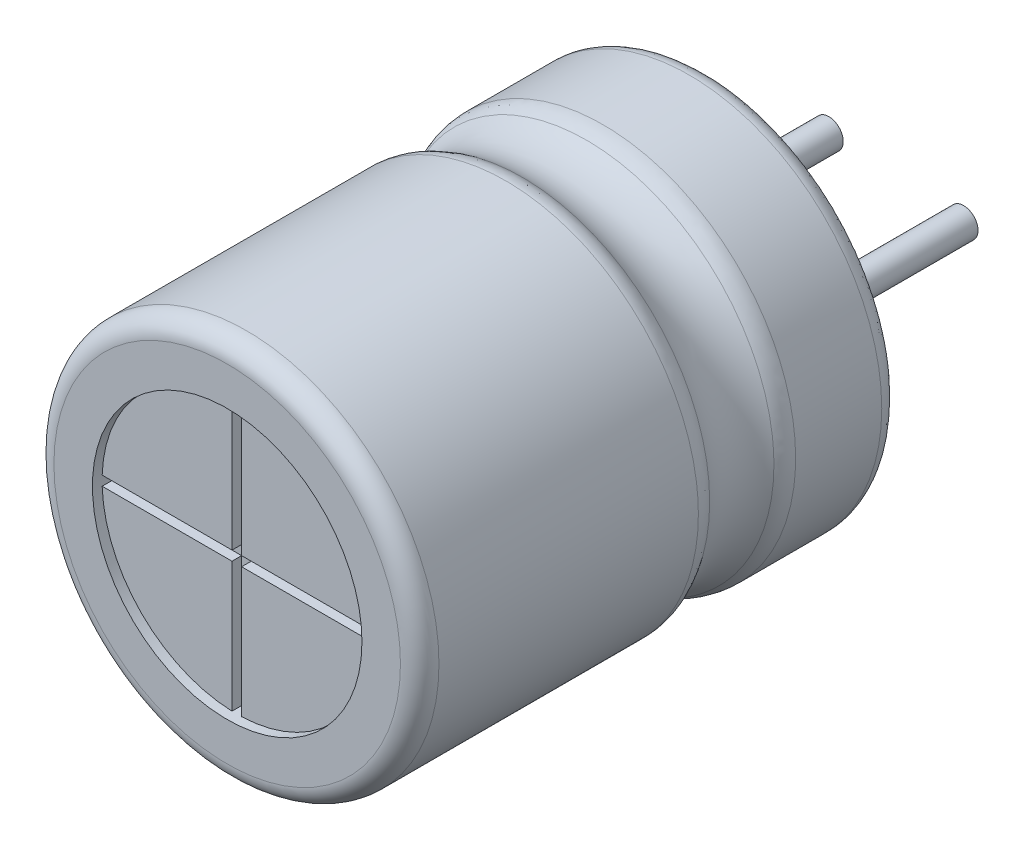
ISO-10303-21;
HEADER;
FILE_DESCRIPTION(('STEP AP214'),'2;1');
FILE_NAME('part.step','',(''),(''),'','','');
FILE_SCHEMA(('AUTOMOTIVE_DESIGN { 1 0 10303 214 1 1 1 1 }'));
ENDSEC;
DATA;
#1=APPLICATION_CONTEXT('core data for automotive mechanical design processes');
#2=APPLICATION_PROTOCOL_DEFINITION('international standard','automotive_design',2000,#1);
#3=PRODUCT_CONTEXT('',#1,'mechanical');
#4=PRODUCT('Part','Part','',(#3));
#5=PRODUCT_RELATED_PRODUCT_CATEGORY('part','',(#4));
#6=PRODUCT_DEFINITION_FORMATION('','',#4);
#7=PRODUCT_DEFINITION_CONTEXT('part definition',#1,'design');
#8=PRODUCT_DEFINITION('design','',#6,#7);
#9=PRODUCT_DEFINITION_SHAPE('','',#8);
#10=(LENGTH_UNIT() NAMED_UNIT(*) SI_UNIT(.MILLI.,.METRE.));
#11=(NAMED_UNIT(*) PLANE_ANGLE_UNIT() SI_UNIT($,.RADIAN.));
#12=(NAMED_UNIT(*) SI_UNIT($,.STERADIAN.) SOLID_ANGLE_UNIT());
#13=UNCERTAINTY_MEASURE_WITH_UNIT(LENGTH_MEASURE(1.E-05),#10,'distance_accuracy_value','');
#14=(GEOMETRIC_REPRESENTATION_CONTEXT(3) GLOBAL_UNCERTAINTY_ASSIGNED_CONTEXT((#13)) GLOBAL_UNIT_ASSIGNED_CONTEXT((#10,
#11,#12)) REPRESENTATION_CONTEXT('',''));
#15=CARTESIAN_POINT('',(0.,0.,0.));
#16=DIRECTION('',(0.,0.,1.));
#17=DIRECTION('',(1.,0.,0.));
#18=AXIS2_PLACEMENT_3D('',#15,#16,#17);
#19=CARTESIAN_POINT('',(1.5,0.,-1.9));
#20=DIRECTION('',(0.,0.,1.));
#21=DIRECTION('',(1.,0.,0.));
#22=AXIS2_PLACEMENT_3D('',#19,#20,#21);
#23=PLANE('',#22);
#24=CARTESIAN_POINT('',(1.5,0.,-1.9));
#25=DIRECTION('',(0.,0.,1.));
#26=DIRECTION('',(-1.,0.,0.));
#27=AXIS2_PLACEMENT_3D('',#24,#25,#26);
#28=CIRCLE('',#27,0.15);
#29=CARTESIAN_POINT('',(1.35,0.,-1.9));
#30=VERTEX_POINT('',#29);
#31=EDGE_CURVE('E31',#30,#30,#28,.T.);
#32=ORIENTED_EDGE('',*,*,#31,.F.);
#33=EDGE_LOOP('',(#32));
#34=FACE_BOUND('',#33,.T.);
#35=ADVANCED_FACE('F18',(#34),#23,.F.);
#36=CARTESIAN_POINT('',(1.5,0.,0.3));
#37=DIRECTION('',(0.,0.,1.));
#38=DIRECTION('',(-1.,0.,0.));
#39=AXIS2_PLACEMENT_3D('',#36,#37,#38);
#40=CYLINDRICAL_SURFACE('',#39,0.15);
#41=CARTESIAN_POINT('',(1.5,0.,0.2));
#42=DIRECTION('',(0.,0.,1.));
#43=DIRECTION('',(-1.,0.,0.));
#44=AXIS2_PLACEMENT_3D('',#41,#42,#43);
#45=CIRCLE('',#44,0.15);
#46=CARTESIAN_POINT('',(1.35,0.,0.2));
#47=VERTEX_POINT('',#46);
#48=EDGE_CURVE('E798',#47,#47,#45,.T.);
#49=ORIENTED_EDGE('',*,*,#48,.F.);
#50=DIRECTION('',(0.,0.,-1.));
#51=VECTOR('',#50,1.);
#52=CARTESIAN_POINT('',(1.35,0.,0.3));
#53=LINE('',#52,#51);
#54=EDGE_CURVE('E11',#47,#30,#53,.T.);
#55=ORIENTED_EDGE('',*,*,#54,.T.);
#56=ORIENTED_EDGE('',*,*,#31,.T.);
#57=ORIENTED_EDGE('',*,*,#54,.F.);
#58=EDGE_LOOP('',(#49,#55,#56,#57));
#59=FACE_BOUND('',#58,.T.);
#60=ADVANCED_FACE('F453',(#59),#40,.T.);
#61=CARTESIAN_POINT('',(0.75,0.,0.2));
#62=DIRECTION('',(0.,0.,1.));
#63=DIRECTION('',(1.,0.,0.));
#64=AXIS2_PLACEMENT_3D('',#61,#62,#63);
#65=PLANE('',#64);
#66=CARTESIAN_POINT('',(0.75,0.,0.2));
#67=DIRECTION('',(0.,0.,1.));
#68=DIRECTION('',(1.,0.,0.));
#69=AXIS2_PLACEMENT_3D('',#66,#67,#68);
#70=CIRCLE('',#69,1.4);
#71=CARTESIAN_POINT('',(2.15,0.,0.2));
#72=VERTEX_POINT('',#71);
#73=EDGE_CURVE('E795',#72,#72,#70,.T.);
#74=ORIENTED_EDGE('',*,*,#73,.F.);
#75=EDGE_LOOP('',(#74));
#76=FACE_BOUND('',#75,.T.);
#77=ORIENTED_EDGE('',*,*,#48,.T.);
#78=EDGE_LOOP('',(#77));
#79=FACE_BOUND('',#78,.T.);
#80=CARTESIAN_POINT('',(0.,0.,0.2));
#81=DIRECTION('',(0.,0.,1.));
#82=DIRECTION('',(-1.,0.,0.));
#83=AXIS2_PLACEMENT_3D('',#80,#81,#82);
#84=CIRCLE('',#83,0.15);
#85=CARTESIAN_POINT('',(-0.15,0.,0.2));
#86=VERTEX_POINT('',#85);
#87=EDGE_CURVE('E801',#86,#86,#84,.T.);
#88=ORIENTED_EDGE('',*,*,#87,.T.);
#89=EDGE_LOOP('',(#88));
#90=FACE_BOUND('',#89,.T.);
#91=ADVANCED_FACE('F401',(#76,#79,#90),#65,.F.);
#92=CARTESIAN_POINT('',(0.75,0.,0.3));
#93=DIRECTION('',(0.,0.,-1.));
#94=DIRECTION('',(1.,0.,0.));
#95=AXIS2_PLACEMENT_3D('',#92,#93,#94);
#96=CYLINDRICAL_SURFACE('',#95,1.4);
#97=DIRECTION('',(0.,0.,-1.));
#98=VECTOR('',#97,1.);
#99=CARTESIAN_POINT('',(2.15,0.,0.3));
#100=LINE('',#99,#98);
#101=CARTESIAN_POINT('',(2.15,0.,0.));
#102=VERTEX_POINT('',#101);
#103=EDGE_CURVE('E805',#72,#102,#100,.T.);
#104=ORIENTED_EDGE('',*,*,#103,.T.);
#105=CARTESIAN_POINT('',(0.75,0.,0.));
#106=DIRECTION('',(0.,0.,-1.));
#107=DIRECTION('',(1.,0.,0.));
#108=AXIS2_PLACEMENT_3D('',#105,#106,#107);
#109=CIRCLE('',#108,1.4);
#110=EDGE_CURVE('E816',#102,#102,#109,.T.);
#111=ORIENTED_EDGE('',*,*,#110,.T.);
#112=ORIENTED_EDGE('',*,*,#103,.F.);
#113=ORIENTED_EDGE('',*,*,#73,.T.);
#114=EDGE_LOOP('',(#104,#111,#112,#113));
#115=FACE_BOUND('',#114,.T.);
#116=ADVANCED_FACE('F437',(#115),#96,.F.);
#117=CARTESIAN_POINT('',(0.,0.,0.3));
#118=DIRECTION('',(0.,0.,1.));
#119=DIRECTION('',(-1.,0.,0.));
#120=AXIS2_PLACEMENT_3D('',#117,#118,#119);
#121=CYLINDRICAL_SURFACE('',#120,0.15);
#122=ORIENTED_EDGE('',*,*,#87,.F.);
#123=DIRECTION('',(0.,0.,-1.));
#124=VECTOR('',#123,1.);
#125=CARTESIAN_POINT('',(-0.15,0.,0.3));
#126=LINE('',#125,#124);
#127=CARTESIAN_POINT('',(-0.15,0.,-2.));
#128=VERTEX_POINT('',#127);
#129=EDGE_CURVE('E808',#86,#128,#126,.T.);
#130=ORIENTED_EDGE('',*,*,#129,.T.);
#131=CARTESIAN_POINT('',(0.,0.,-2.));
#132=DIRECTION('',(0.,0.,1.));
#133=DIRECTION('',(-1.,0.,0.));
#134=AXIS2_PLACEMENT_3D('',#131,#132,#133);
#135=CIRCLE('',#134,0.15);
#136=EDGE_CURVE('E809',#128,#128,#135,.T.);
#137=ORIENTED_EDGE('',*,*,#136,.T.);
#138=ORIENTED_EDGE('',*,*,#129,.F.);
#139=EDGE_LOOP('',(#122,#130,#137,#138));
#140=FACE_BOUND('',#139,.T.);
#141=ADVANCED_FACE('F317',(#140),#121,.T.);
#142=CARTESIAN_POINT('',(0.75,0.,0.));
#143=DIRECTION('',(0.,0.,-1.));
#144=DIRECTION('',(0.,-1.,0.));
#145=AXIS2_PLACEMENT_3D('',#142,#143,#144);
#146=PLANE('',#145);
#147=ORIENTED_EDGE('',*,*,#110,.F.);
#148=EDGE_LOOP('',(#147));
#149=FACE_BOUND('',#148,.T.);
#150=CARTESIAN_POINT('',(0.75,0.,0.));
#151=DIRECTION('',(0.,0.,-1.));
#152=DIRECTION('',(1.,0.,0.));
#153=AXIS2_PLACEMENT_3D('',#150,#151,#152);
#154=CIRCLE('',#153,1.8);
#155=CARTESIAN_POINT('',(2.55,0.,0.));
#156=VERTEX_POINT('',#155);
#157=EDGE_CURVE('E819',#156,#156,#154,.T.);
#158=ORIENTED_EDGE('',*,*,#157,.T.);
#159=EDGE_LOOP('',(#158));
#160=FACE_BOUND('',#159,.T.);
#161=ADVANCED_FACE('F313',(#149,#160),#146,.T.);
#162=CARTESIAN_POINT('',(0.,0.,-2.));
#163=DIRECTION('',(0.,0.,1.));
#164=DIRECTION('',(1.,0.,0.));
#165=AXIS2_PLACEMENT_3D('',#162,#163,#164);
#166=PLANE('',#165);
#167=ORIENTED_EDGE('',*,*,#136,.F.);
#168=EDGE_LOOP('',(#167));
#169=FACE_BOUND('',#168,.T.);
#170=ADVANCED_FACE('F250',(#169),#166,.F.);
#171=CARTESIAN_POINT('',(2.55,0.,0.));
#172=CARTESIAN_POINT('',(2.66715728752538,0.,0.));
#173=CARTESIAN_POINT('',(2.75,0.,0.0828427124746191));
#174=CARTESIAN_POINT('',(2.75,0.,0.2));
#175=(BOUNDED_CURVE() B_SPLINE_CURVE(3,(#171,#172,#173,#174),.UNSPECIFIED.,.F.,
.F.) B_SPLINE_CURVE_WITH_KNOTS((4,4),(0.,1.),
.UNSPECIFIED.) CURVE() GEOMETRIC_REPRESENTATION_ITEM() RATIONAL_B_SPLINE_CURVE((1.,
0.804737854124365,0.804737854124365,1.)) REPRESENTATION_ITEM(''));
#176=CARTESIAN_POINT('',(0.75,0.,0.));
#177=DIRECTION('',(0.,0.,1.));
#178=AXIS1_PLACEMENT('',#176,#177);
#179=SURFACE_OF_REVOLUTION('',#175,#178);
#180=CARTESIAN_POINT('',(2.55,0.,0.2));
#181=DIRECTION('',(0.,-1.,0.));
#182=DIRECTION('',(0.,0.,-1.));
#183=AXIS2_PLACEMENT_3D('',#180,#181,#182);
#184=CIRCLE('',#183,0.2);
#185=CARTESIAN_POINT('',(2.75,0.,0.2));
#186=VERTEX_POINT('',#185);
#187=EDGE_CURVE('E834',#156,#186,#184,.T.);
#188=ORIENTED_EDGE('',*,*,#187,.T.);
#189=CARTESIAN_POINT('',(0.75,0.,0.2));
#190=DIRECTION('',(0.,0.,-1.));
#191=DIRECTION('',(1.,0.,0.));
#192=AXIS2_PLACEMENT_3D('',#189,#190,#191);
#193=CIRCLE('',#192,2.);
#194=EDGE_CURVE('E838',#186,#186,#193,.T.);
#195=ORIENTED_EDGE('',*,*,#194,.T.);
#196=ORIENTED_EDGE('',*,*,#187,.F.);
#197=ORIENTED_EDGE('',*,*,#157,.F.);
#198=EDGE_LOOP('',(#188,#195,#196,#197));
#199=FACE_BOUND('',#198,.T.);
#200=ADVANCED_FACE('F246',(#199),#179,.T.);
#201=CARTESIAN_POINT('',(0.75,0.,0.2));
#202=DIRECTION('',(0.,0.,1.));
#203=DIRECTION('',(1.,0.,0.));
#204=AXIS2_PLACEMENT_3D('',#201,#202,#203);
#205=CYLINDRICAL_SURFACE('',#204,2.);
#206=CARTESIAN_POINT('',(2.75,0.,1.094848017031));
#207=CARTESIAN_POINT('',(2.75,0.952660709411,1.094848017031));
#208=CARTESIAN_POINT('',(2.257633513842,1.9272904927,1.094848017031));
#209=CARTESIAN_POINT('',(1.244412228651,2.624192256694,1.094848017031));
#210=CARTESIAN_POINT('',(-0.149908868318,2.731223086318,1.094848017031));
#211=CARTESIAN_POINT('',(-1.354436335487,1.988436120794,1.094848017031));
#212=CARTESIAN_POINT('',(-2.237830703038,0.90413309659,1.094848017031));
#213=CARTESIAN_POINT('',(-2.237830702984,-0.904133096575,1.094848017031));
#214=CARTESIAN_POINT('',(-1.354436335519,-1.988436120821,1.094848017031));
#215=CARTESIAN_POINT('',(-0.149908868309,-2.731223086294,1.094848017031));
#216=CARTESIAN_POINT('',(1.244412228653,-2.624192256705,1.094848017031));
#217=CARTESIAN_POINT('',(2.257633513839,-1.927290492697,1.094848017031));
#218=CARTESIAN_POINT('',(2.750000000001,-0.952660709411,1.094848017031));
#219=CARTESIAN_POINT('',(2.75,0.,1.094848017031));
#220=(BOUNDED_CURVE() B_SPLINE_CURVE(13,(#206,#207,#208,#209,#210,#211,#212,#213,#214,#215,#216,
#217,#218,#219),.UNSPECIFIED.,.T.,.F.) B_SPLINE_CURVE_WITH_KNOTS((14,14),(0.,12.566370614359),
.UNSPECIFIED.) CURVE() GEOMETRIC_REPRESENTATION_ITEM() RATIONAL_B_SPLINE_CURVE((1.,1.,
0.999999999999,1.000000000002,0.999999999996,1.000000000006,0.999999999992,1.000000000009,
0.999999999991,1.000000000006,0.999999999997,1.000000000001,1.,1.)) REPRESENTATION_ITEM(''));
#221=CARTESIAN_POINT('',(2.75,0.,1.094848017031));
#222=VERTEX_POINT('',#221);
#223=EDGE_CURVE('E1036',#222,#222,#220,.F.);
#224=ORIENTED_EDGE('',*,*,#223,.T.);
#225=DIRECTION('',(0.,0.,1.));
#226=VECTOR('',#225,1.);
#227=CARTESIAN_POINT('',(2.75,0.,0.2));
#228=LINE('',#227,#226);
#229=EDGE_CURVE('E1034',#186,#222,#228,.T.);
#230=ORIENTED_EDGE('',*,*,#229,.F.);
#231=ORIENTED_EDGE('',*,*,#194,.F.);
#232=ORIENTED_EDGE('',*,*,#229,.T.);
#233=EDGE_LOOP('',(#224,#230,#231,#232));
#234=FACE_BOUND('',#233,.T.);
#235=ADVANCED_FACE('F249',(#234),#205,.T.);
#236=CARTESIAN_POINT('',(2.75,0.,1.094848017031));
#237=CARTESIAN_POINT('',(2.750000000001,-0.952660709411,1.094848017031));
#238=CARTESIAN_POINT('',(2.257633513839,-1.927290492697,1.094848017031));
#239=CARTESIAN_POINT('',(1.244412228653,-2.624192256705,1.094848017031));
#240=CARTESIAN_POINT('',(-0.149908868309,-2.731223086294,1.094848017031));
#241=CARTESIAN_POINT('',(-1.354436335519,-1.988436120821,1.094848017031));
#242=CARTESIAN_POINT('',(-2.237830702984,-0.904133096575,1.094848017031));
#243=CARTESIAN_POINT('',(-2.237830703038,0.90413309659,1.094848017031));
#244=CARTESIAN_POINT('',(-1.354436335487,1.988436120794,1.094848017031));
#245=CARTESIAN_POINT('',(-0.149908868318,2.731223086318,1.094848017031));
#246=CARTESIAN_POINT('',(1.244412228651,2.624192256694,1.094848017031));
#247=CARTESIAN_POINT('',(2.257633513842,1.9272904927,1.094848017031));
#248=CARTESIAN_POINT('',(2.75,0.952660709411,1.094848017031));
#249=CARTESIAN_POINT('',(2.75,0.,1.094848017031));
#250=CARTESIAN_POINT('',(2.75,0.,1.189055828844));
#251=CARTESIAN_POINT('',(2.750000000001,-0.952660709411,1.189055828844));
#252=CARTESIAN_POINT('',(2.257633513838,-1.927290492698,1.189055828844));
#253=CARTESIAN_POINT('',(1.244412228656,-2.624192256701,1.189055828844));
#254=CARTESIAN_POINT('',(-0.149908868317,-2.731223086302,1.189055828844));
#255=CARTESIAN_POINT('',(-1.354436335501,-1.988436120811,1.189055828844));
#256=CARTESIAN_POINT('',(-2.23783070301,-0.904133096582,1.189055828845));
#257=CARTESIAN_POINT('',(-2.237830703011,0.904133096587,1.189055828844));
#258=CARTESIAN_POINT('',(-1.354436335504,1.988436120803,1.189055828845));
#259=CARTESIAN_POINT('',(-0.149908868311,2.731223086309,1.189055828844));
#260=CARTESIAN_POINT('',(1.24441222865,2.624192256698,1.189055828844));
#261=CARTESIAN_POINT('',(2.257633513841,1.927290492699,1.189055828844));
#262=CARTESIAN_POINT('',(2.75,0.952660709411,1.189055828844));
#263=CARTESIAN_POINT('',(2.75,0.,1.189055828844));
#264=CARTESIAN_POINT('',(2.696143503792,0.,1.266351298459));
#265=CARTESIAN_POINT('',(2.696143503793,-0.927007225469,1.266351298459));
#266=CARTESIAN_POINT('',(2.217035584527,-1.875391936142,1.266351298459));
#267=CARTESIAN_POINT('',(1.231098573499,-2.553527356544,1.266351298459));
#268=CARTESIAN_POINT('',(-0.12567589904,-2.657676033399,1.266351298459));
#269=CARTESIAN_POINT('',(-1.297767551745,-1.934891019622,1.26635129846));
#270=CARTESIAN_POINT('',(-2.157373656536,-0.87978637623,1.266351298459));
#271=CARTESIAN_POINT('',(-2.157373656561,0.879786376244,1.26635129846));
#272=CARTESIAN_POINT('',(-1.297767551737,1.934891019597,1.266351298459));
#273=CARTESIAN_POINT('',(-0.125675899035,2.657676033421,1.26635129846));
#274=CARTESIAN_POINT('',(1.231098573489,2.553527356534,1.266351298459));
#275=CARTESIAN_POINT('',(2.217035584533,1.875391936144,1.266351298459));
#276=CARTESIAN_POINT('',(2.696143503792,0.927007225469,1.266351298459));
#277=CARTESIAN_POINT('',(2.696143503792,0.,1.266351298459));
#278=(BOUNDED_SURFACE() B_SPLINE_SURFACE(2,13,((#236,#237,#238,#239,#240,#241,#242,#243,#244,
#245,#246,#247,#248,#249),(#250,#251,#252,#253,#254,#255,#256,#257,#258,#259,#260,#261,#262,
#263),(#264,#265,#266,#267,#268,#269,#270,#271,#272,#273,#274,#275,#276,#277)),.UNSPECIFIED.,
.F.,.T.,.F.) B_SPLINE_SURFACE_WITH_KNOTS((3,3),(14,14),(0.,12.566370614359),(0.,
12.566370614359),.UNSPECIFIED.) GEOMETRIC_REPRESENTATION_ITEM() RATIONAL_B_SPLINE_SURFACE(((1.,
1.,1.000000000001,0.999999999997,1.000000000006,0.999999999991,1.000000000009,0.999999999992,
1.000000000006,0.999999999996,1.000000000002,0.999999999999,1.,1.),(0.954064553889,
0.954064553889,0.95406455389,0.954064553887,0.954064553892,0.954064553885,0.954064553893,
0.954064553887,0.95406455389,0.954064553889,0.954064553889,0.954064553889,0.954064553889,
0.954064553889),(1.,1.,1.000000000001,0.999999999997,1.000000000006,0.999999999991,
1.000000000009,0.999999999992,1.000000000006,0.999999999996,1.000000000002,0.999999999999,1.,1.))) REPRESENTATION_ITEM('') SURFACE());
#279=CARTESIAN_POINT('',(2.75,0.,1.094848017031));
#280=CARTESIAN_POINT('',(2.75,0.,1.189055828844));
#281=CARTESIAN_POINT('',(2.696143503792,0.,1.266351298459));
#282=(BOUNDED_CURVE() B_SPLINE_CURVE(2,(#279,#280,#281),.UNSPECIFIED.,.F.,
.F.) B_SPLINE_CURVE_WITH_KNOTS((3,3),(0.,12.566370614359),
.UNSPECIFIED.) CURVE() GEOMETRIC_REPRESENTATION_ITEM() RATIONAL_B_SPLINE_CURVE((1.,
0.954064553889,1.)) REPRESENTATION_ITEM(''));
#283=CARTESIAN_POINT('',(2.696143503792,0.,1.266351298459));
#284=VERTEX_POINT('',#283);
#285=EDGE_CURVE('E1038',#222,#284,#282,.T.);
#286=CARTESIAN_POINT('',(2.696143503792,0.,1.266351298459));
#287=CARTESIAN_POINT('',(2.696143503793,-0.927007225469,1.266351298459));
#288=CARTESIAN_POINT('',(2.217035584527,-1.875391936142,1.266351298459));
#289=CARTESIAN_POINT('',(1.231098573499,-2.553527356544,1.266351298459));
#290=CARTESIAN_POINT('',(-0.12567589904,-2.657676033399,1.266351298459));
#291=CARTESIAN_POINT('',(-1.297767551745,-1.934891019622,1.26635129846));
#292=CARTESIAN_POINT('',(-2.157373656536,-0.87978637623,1.266351298459));
#293=CARTESIAN_POINT('',(-2.157373656561,0.879786376244,1.26635129846));
#294=CARTESIAN_POINT('',(-1.297767551737,1.934891019597,1.266351298459));
#295=CARTESIAN_POINT('',(-0.125675899035,2.657676033421,1.26635129846));
#296=CARTESIAN_POINT('',(1.231098573489,2.553527356534,1.266351298459));
#297=CARTESIAN_POINT('',(2.217035584533,1.875391936144,1.266351298459));
#298=CARTESIAN_POINT('',(2.696143503792,0.927007225469,1.266351298459));
#299=CARTESIAN_POINT('',(2.696143503792,0.,1.266351298459));
#300=(BOUNDED_CURVE() B_SPLINE_CURVE(13,(#286,#287,#288,#289,#290,#291,#292,#293,#294,#295,#296,
#297,#298,#299),.UNSPECIFIED.,.T.,.F.) B_SPLINE_CURVE_WITH_KNOTS((14,14),(0.,12.566370614359),
.UNSPECIFIED.) CURVE() GEOMETRIC_REPRESENTATION_ITEM() RATIONAL_B_SPLINE_CURVE((1.,1.,
1.000000000001,0.999999999997,1.000000000006,0.999999999991,1.000000000009,0.999999999992,
1.000000000006,0.999999999996,1.000000000002,0.999999999999,1.,1.)) REPRESENTATION_ITEM(''));
#301=EDGE_CURVE('E353',#284,#284,#300,.T.);
#302=ORIENTED_EDGE('',*,*,#285,.T.);
#303=ORIENTED_EDGE('',*,*,#301,.T.);
#304=ORIENTED_EDGE('',*,*,#285,.F.);
#305=ORIENTED_EDGE('',*,*,#223,.F.);
#306=EDGE_LOOP('',(#302,#303,#304,#305));
#307=FACE_BOUND('',#306,.T.);
#308=ADVANCED_FACE('F319',(#307),#278,.T.);
#309=CARTESIAN_POINT('',(2.69859548767745,0.,1.26285946455788));
#310=CARTESIAN_POINT('',(2.55063819946358,0.,1.47193405608885));
#311=CARTESIAN_POINT('',(2.55063819946359,0.,1.7280659439112));
#312=CARTESIAN_POINT('',(2.69859548767747,0.,1.93714053544216));
#313=(BOUNDED_CURVE() B_SPLINE_CURVE(3,(#309,#310,#311,#312),.UNSPECIFIED.,.F.,
.F.) B_SPLINE_CURVE_WITH_KNOTS((4,4),(0.,1.),
.UNSPECIFIED.) CURVE() GEOMETRIC_REPRESENTATION_ITEM() RATIONAL_B_SPLINE_CURVE((1.,
0.877518058654672,0.877518058654672,1.)) REPRESENTATION_ITEM(''));
#314=CARTESIAN_POINT('',(0.75,0.,0.));
#315=DIRECTION('',(0.,0.,1.));
#316=AXIS1_PLACEMENT('',#314,#315);
#317=SURFACE_OF_REVOLUTION('',#313,#316);
#318=CARTESIAN_POINT('',(0.75,0.,1.93364870154046));
#319=DIRECTION('',(0.,0.,-1.));
#320=DIRECTION('',(1.,0.,0.));
#321=AXIS2_PLACEMENT_3D('',#318,#319,#320);
#322=CIRCLE('',#321,1.94614350379278);
#323=CARTESIAN_POINT('',(2.696143503792,0.,1.933648701541));
#324=VERTEX_POINT('',#323);
#325=EDGE_CURVE('E365',#324,#324,#322,.T.);
#326=ORIENTED_EDGE('',*,*,#325,.T.);
#327=CARTESIAN_POINT('',(3.175,0.,1.6));
#328=DIRECTION('',(0.,1.,0.));
#329=DIRECTION('',(-0.728199992692891,0.,-0.685364699004897));
#330=AXIS2_PLACEMENT_3D('',#327,#328,#329);
#331=CIRCLE('',#330,0.583630876496);
#332=EDGE_CURVE('E357',#284,#324,#331,.T.);
#333=ORIENTED_EDGE('',*,*,#332,.F.);
#334=ORIENTED_EDGE('',*,*,#301,.F.);
#335=ORIENTED_EDGE('',*,*,#332,.T.);
#336=EDGE_LOOP('',(#326,#333,#334,#335));
#337=FACE_BOUND('',#336,.T.);
#338=ADVANCED_FACE('F20',(#337),#317,.T.);
#339=CARTESIAN_POINT('',(2.696143503792,0.,1.933648701541));
#340=CARTESIAN_POINT('',(2.696143503793,-0.927007225469,1.933648701541));
#341=CARTESIAN_POINT('',(2.217035584528,-1.875391936142,1.933648701541));
#342=CARTESIAN_POINT('',(1.231098573497,-2.553527356544,1.933648701541));
#343=CARTESIAN_POINT('',(-0.125675899037,-2.657676033399,1.933648701541));
#344=CARTESIAN_POINT('',(-1.29776755175,-1.934891019622,1.933648701541));
#345=CARTESIAN_POINT('',(-2.15737365653,-0.87978637623,1.933648701541));
#346=CARTESIAN_POINT('',(-2.157373656566,0.879786376245,1.933648701541));
#347=CARTESIAN_POINT('',(-1.297767551733,1.934891019596,1.933648701541));
#348=CARTESIAN_POINT('',(-0.125675899037,2.657676033422,1.933648701541));
#349=CARTESIAN_POINT('',(1.231098573491,2.553527356534,1.933648701541));
#350=CARTESIAN_POINT('',(2.217035584532,1.875391936144,1.933648701541));
#351=CARTESIAN_POINT('',(2.696143503792,0.927007225469,1.933648701541));
#352=CARTESIAN_POINT('',(2.696143503792,0.,1.933648701541));
#353=CARTESIAN_POINT('',(2.75,0.,2.010944171156));
#354=CARTESIAN_POINT('',(2.750000000001,-0.952660709411,2.010944171156));
#355=CARTESIAN_POINT('',(2.257633513839,-1.927290492698,2.010944171156));
#356=CARTESIAN_POINT('',(1.244412228654,-2.6241922567,2.010944171156));
#357=CARTESIAN_POINT('',(-0.149908868315,-2.731223086304,2.010944171155));
#358=CARTESIAN_POINT('',(-1.354436335502,-1.98843612081,2.010944171156));
#359=CARTESIAN_POINT('',(-2.237830703011,-0.904133096582,2.010944171155));
#360=CARTESIAN_POINT('',(-2.23783070301,0.904133096583,2.010944171156));
#361=CARTESIAN_POINT('',(-1.354436335504,1.988436120807,2.010944171155));
#362=CARTESIAN_POINT('',(-0.149908868312,2.731223086306,2.010944171156));
#363=CARTESIAN_POINT('',(1.244412228651,2.624192256699,2.010944171156));
#364=CARTESIAN_POINT('',(2.257633513841,1.927290492698,2.010944171156));
#365=CARTESIAN_POINT('',(2.75,0.952660709411,2.010944171156));
#366=CARTESIAN_POINT('',(2.75,0.,2.010944171156));
#367=CARTESIAN_POINT('',(2.75,0.,2.105151982969));
#368=CARTESIAN_POINT('',(2.750000000001,-0.952660709411,2.105151982969));
#369=CARTESIAN_POINT('',(2.257633513838,-1.927290492697,2.105151982969));
#370=CARTESIAN_POINT('',(1.244412228657,-2.624192256704,2.10515198297));
#371=CARTESIAN_POINT('',(-0.149908868316,-2.731223086295,2.105151982969));
#372=CARTESIAN_POINT('',(-1.354436335509,-1.988436120819,2.10515198297));
#373=CARTESIAN_POINT('',(-2.237830702995,-0.904133096577,2.105151982968));
#374=CARTESIAN_POINT('',(-2.237830703027,0.904133096592,2.10515198297));
#375=CARTESIAN_POINT('',(-1.354436335496,1.988436120793,2.105151982969));
#376=CARTESIAN_POINT('',(-0.149908868313,2.731223086319,2.10515198297));
#377=CARTESIAN_POINT('',(1.244412228648,2.624192256693,2.105151982969));
#378=CARTESIAN_POINT('',(2.257633513843,1.9272904927,2.105151982969));
#379=CARTESIAN_POINT('',(2.75,0.952660709411,2.105151982969));
#380=CARTESIAN_POINT('',(2.75,0.,2.105151982969));
#381=(BOUNDED_SURFACE() B_SPLINE_SURFACE(2,13,((#339,#340,#341,#342,#343,#344,#345,#346,#347,
#348,#349,#350,#351,#352),(#353,#354,#355,#356,#357,#358,#359,#360,#361,#362,#363,#364,#365,
#366),(#367,#368,#369,#370,#371,#372,#373,#374,#375,#376,#377,#378,#379,#380)),.UNSPECIFIED.,
.F.,.T.,.F.) B_SPLINE_SURFACE_WITH_KNOTS((3,3),(14,14),(0.,12.566370614359),(0.,
12.566370614359),.UNSPECIFIED.) GEOMETRIC_REPRESENTATION_ITEM() RATIONAL_B_SPLINE_SURFACE(((1.,
1.,1.000000000001,0.999999999997,1.000000000006,0.999999999991,1.000000000009,0.999999999992,
1.000000000006,0.999999999996,1.000000000002,0.999999999999,1.,1.),(0.954064553889,
0.954064553889,0.95406455389,0.954064553887,0.954064553891,0.954064553886,0.954064553891,
0.954064553888,0.954064553889,0.95406455389,0.954064553888,0.954064553889,0.954064553889,
0.954064553889),(1.,1.,1.000000000001,0.999999999997,1.000000000006,0.999999999991,
1.000000000009,0.999999999992,1.000000000006,0.999999999996,1.000000000002,0.999999999999,1.,1.))) REPRESENTATION_ITEM('') SURFACE());
#382=CARTESIAN_POINT('',(2.696143503792,0.,1.933648701541));
#383=CARTESIAN_POINT('',(2.75,0.,2.010944171156));
#384=CARTESIAN_POINT('',(2.75,0.,2.105151982969));
#385=(BOUNDED_CURVE() B_SPLINE_CURVE(2,(#382,#383,#384),.UNSPECIFIED.,.F.,
.F.) B_SPLINE_CURVE_WITH_KNOTS((3,3),(0.,12.566370614359),
.UNSPECIFIED.) CURVE() GEOMETRIC_REPRESENTATION_ITEM() RATIONAL_B_SPLINE_CURVE((1.,
0.954064553889,1.)) REPRESENTATION_ITEM(''));
#386=CARTESIAN_POINT('',(2.75,0.,2.105151982969));
#387=VERTEX_POINT('',#386);
#388=EDGE_CURVE('E366',#324,#387,#385,.T.);
#389=CARTESIAN_POINT('',(2.75,0.,2.105151982969));
#390=CARTESIAN_POINT('',(2.750000000001,-0.952660709411,2.105151982969));
#391=CARTESIAN_POINT('',(2.257633513838,-1.927290492697,2.105151982969));
#392=CARTESIAN_POINT('',(1.244412228657,-2.624192256704,2.10515198297));
#393=CARTESIAN_POINT('',(-0.149908868316,-2.731223086295,2.105151982969));
#394=CARTESIAN_POINT('',(-1.354436335509,-1.988436120819,2.10515198297));
#395=CARTESIAN_POINT('',(-2.237830702995,-0.904133096577,2.105151982968));
#396=CARTESIAN_POINT('',(-2.237830703027,0.904133096592,2.10515198297));
#397=CARTESIAN_POINT('',(-1.354436335496,1.988436120793,2.105151982969));
#398=CARTESIAN_POINT('',(-0.149908868313,2.731223086319,2.10515198297));
#399=CARTESIAN_POINT('',(1.244412228648,2.624192256693,2.105151982969));
#400=CARTESIAN_POINT('',(2.257633513843,1.9272904927,2.105151982969));
#401=CARTESIAN_POINT('',(2.75,0.952660709411,2.105151982969));
#402=CARTESIAN_POINT('',(2.75,0.,2.105151982969));
#403=(BOUNDED_CURVE() B_SPLINE_CURVE(13,(#389,#390,#391,#392,#393,#394,#395,#396,#397,#398,#399,
#400,#401,#402),.UNSPECIFIED.,.T.,.F.) B_SPLINE_CURVE_WITH_KNOTS((14,14),(0.,12.566370614359),
.UNSPECIFIED.) CURVE() GEOMETRIC_REPRESENTATION_ITEM() RATIONAL_B_SPLINE_CURVE((1.,1.,
1.000000000001,0.999999999997,1.000000000006,0.999999999991,1.000000000009,0.999999999992,
1.000000000006,0.999999999996,1.000000000002,0.999999999999,1.,1.)) REPRESENTATION_ITEM(''));
#404=EDGE_CURVE('E425',#387,#387,#403,.T.);
#405=ORIENTED_EDGE('',*,*,#388,.T.);
#406=ORIENTED_EDGE('',*,*,#404,.T.);
#407=ORIENTED_EDGE('',*,*,#388,.F.);
#408=ORIENTED_EDGE('',*,*,#325,.F.);
#409=EDGE_LOOP('',(#405,#406,#407,#408));
#410=FACE_BOUND('',#409,.T.);
#411=ADVANCED_FACE('F389',(#410),#381,.T.);
#412=CARTESIAN_POINT('',(0.75,0.,2.));
#413=DIRECTION('',(0.,0.,1.));
#414=DIRECTION('',(1.,0.,0.));
#415=AXIS2_PLACEMENT_3D('',#412,#413,#414);
#416=CYLINDRICAL_SURFACE('',#415,2.);
#417=CARTESIAN_POINT('',(0.75,0.,4.8));
#418=DIRECTION('',(0.,0.,-1.));
#419=DIRECTION('',(1.,0.,0.));
#420=AXIS2_PLACEMENT_3D('',#417,#418,#419);
#421=CIRCLE('',#420,2.);
#422=CARTESIAN_POINT('',(2.75,0.,4.8));
#423=VERTEX_POINT('',#422);
#424=EDGE_CURVE('E839',#423,#423,#421,.T.);
#425=ORIENTED_EDGE('',*,*,#424,.T.);
#426=DIRECTION('',(0.,0.,1.));
#427=VECTOR('',#426,1.);
#428=CARTESIAN_POINT('',(2.75,0.,2.));
#429=LINE('',#428,#427);
#430=EDGE_CURVE('E428',#387,#423,#429,.T.);
#431=ORIENTED_EDGE('',*,*,#430,.F.);
#432=ORIENTED_EDGE('',*,*,#404,.F.);
#433=ORIENTED_EDGE('',*,*,#430,.T.);
#434=EDGE_LOOP('',(#425,#431,#432,#433));
#435=FACE_BOUND('',#434,.T.);
#436=ADVANCED_FACE('F309',(#435),#416,.T.);
#437=CARTESIAN_POINT('',(0.75,0.,4.8));
#438=DIRECTION('',(0.,0.,1.));
#439=DIRECTION('',(1.,0.,0.));
#440=AXIS2_PLACEMENT_3D('',#437,#438,#439);
#441=TOROIDAL_SURFACE('',#440,1.8,0.2);
#442=CARTESIAN_POINT('',(2.55,0.,4.8));
#443=DIRECTION('',(0.,-1.,0.));
#444=DIRECTION('',(1.,0.,0.));
#445=AXIS2_PLACEMENT_3D('',#442,#443,#444);
#446=CIRCLE('',#445,0.2);
#447=CARTESIAN_POINT('',(2.55,0.,5.));
#448=VERTEX_POINT('',#447);
#449=EDGE_CURVE('E849',#423,#448,#446,.T.);
#450=ORIENTED_EDGE('',*,*,#449,.T.);
#451=CARTESIAN_POINT('',(0.75,0.,5.));
#452=DIRECTION('',(0.,0.,-1.));
#453=DIRECTION('',(1.,0.,0.));
#454=AXIS2_PLACEMENT_3D('',#451,#452,#453);
#455=CIRCLE('',#454,1.8);
#456=EDGE_CURVE('E853',#448,#448,#455,.T.);
#457=ORIENTED_EDGE('',*,*,#456,.T.);
#458=ORIENTED_EDGE('',*,*,#449,.F.);
#459=ORIENTED_EDGE('',*,*,#424,.F.);
#460=EDGE_LOOP('',(#450,#457,#458,#459));
#461=FACE_BOUND('',#460,.T.);
#462=ADVANCED_FACE('F305',(#461),#441,.T.);
#463=CARTESIAN_POINT('',(0.75,0.,5.));
#464=DIRECTION('',(0.,0.,-1.));
#465=DIRECTION('',(0.,-1.,0.));
#466=AXIS2_PLACEMENT_3D('',#463,#464,#465);
#467=PLANE('',#466);
#468=ORIENTED_EDGE('',*,*,#456,.F.);
#469=EDGE_LOOP('',(#468));
#470=FACE_BOUND('',#469,.T.);
#471=CARTESIAN_POINT('',(0.75,0.,5.));
#472=DIRECTION('',(0.,0.,-1.));
#473=DIRECTION('',(1.,0.,0.));
#474=AXIS2_PLACEMENT_3D('',#471,#472,#473);
#475=CIRCLE('',#474,1.4);
#476=CARTESIAN_POINT('',(2.15,0.,5.));
#477=VERTEX_POINT('',#476);
#478=EDGE_CURVE('E854',#477,#477,#475,.T.);
#479=ORIENTED_EDGE('',*,*,#478,.T.);
#480=EDGE_LOOP('',(#479));
#481=FACE_BOUND('',#480,.T.);
#482=ADVANCED_FACE('F308',(#470,#481),#467,.F.);
#483=CARTESIAN_POINT('',(0.75,0.,5.));
#484=DIRECTION('',(0.,0.,-1.));
#485=DIRECTION('',(1.,0.,0.));
#486=AXIS2_PLACEMENT_3D('',#483,#484,#485);
#487=CYLINDRICAL_SURFACE('',#486,1.4);
#488=CARTESIAN_POINT('',(0.75,0.,4.8));
#489=DIRECTION('',(0.,0.,-1.));
#490=DIRECTION('',(-1.,0.,0.));
#491=AXIS2_PLACEMENT_3D('',#488,#489,#490);
#492=CIRCLE('',#491,1.4);
#493=CARTESIAN_POINT('',(2.15,0.,4.8));
#494=VERTEX_POINT('',#493);
#495=CARTESIAN_POINT('',(2.149106857963,-0.05,4.8));
#496=VERTEX_POINT('',#495);
#497=EDGE_CURVE('E858',#494,#496,#492,.T.);
#498=ORIENTED_EDGE('',*,*,#497,.T.);
#499=DIRECTION('',(0.,0.,-1.));
#500=VECTOR('',#499,1.);
#501=CARTESIAN_POINT('',(2.149106857963,-0.05,4.7));
#502=LINE('',#501,#500);
#503=CARTESIAN_POINT('',(2.149106857963,-0.05000000000001,4.9));
#504=VERTEX_POINT('',#503);
#505=EDGE_CURVE('E871',#504,#496,#502,.T.);
#506=ORIENTED_EDGE('',*,*,#505,.F.);
#507=CARTESIAN_POINT('',(0.75,0.,4.9));
#508=DIRECTION('',(0.,0.,1.));
#509=DIRECTION('',(-1.,0.,0.));
#510=AXIS2_PLACEMENT_3D('',#507,#508,#509);
#511=CIRCLE('',#510,1.4);
#512=CARTESIAN_POINT('',(0.8,-1.399106857963,4.9));
#513=VERTEX_POINT('',#512);
#514=EDGE_CURVE('E879',#513,#504,#511,.T.);
#515=ORIENTED_EDGE('',*,*,#514,.F.);
#516=DIRECTION('',(0.,0.,-1.));
#517=VECTOR('',#516,1.);
#518=CARTESIAN_POINT('',(0.8,-1.399106857963,4.7));
#519=LINE('',#518,#517);
#520=CARTESIAN_POINT('',(0.8,-1.399106857963,4.8));
#521=VERTEX_POINT('',#520);
#522=EDGE_CURVE('E864',#513,#521,#519,.T.);
#523=ORIENTED_EDGE('',*,*,#522,.T.);
#524=CARTESIAN_POINT('',(0.75,0.,4.8));
#525=DIRECTION('',(0.,0.,-1.));
#526=DIRECTION('',(-1.,0.,0.));
#527=AXIS2_PLACEMENT_3D('',#524,#525,#526);
#528=CIRCLE('',#527,1.4);
#529=CARTESIAN_POINT('',(0.7,-1.399106857963,4.8));
#530=VERTEX_POINT('',#529);
#531=EDGE_CURVE('E886',#521,#530,#528,.T.);
#532=ORIENTED_EDGE('',*,*,#531,.T.);
#533=DIRECTION('',(0.,0.,-1.));
#534=VECTOR('',#533,1.);
#535=CARTESIAN_POINT('',(0.7,-1.399106857963,4.7));
#536=LINE('',#535,#534);
#537=CARTESIAN_POINT('',(0.7,-1.399106857963,4.9));
#538=VERTEX_POINT('',#537);
#539=EDGE_CURVE('E869',#538,#530,#536,.T.);
#540=ORIENTED_EDGE('',*,*,#539,.F.);
#541=CARTESIAN_POINT('',(0.75,0.,4.9));
#542=DIRECTION('',(0.,0.,1.));
#543=DIRECTION('',(-1.,0.,0.));
#544=AXIS2_PLACEMENT_3D('',#541,#542,#543);
#545=CIRCLE('',#544,1.4);
#546=CARTESIAN_POINT('',(-0.649106857963,-0.04999999999998,4.9));
#547=VERTEX_POINT('',#546);
#548=EDGE_CURVE('E870',#547,#538,#545,.T.);
#549=ORIENTED_EDGE('',*,*,#548,.F.);
#550=DIRECTION('',(0.,0.,-1.));
#551=VECTOR('',#550,1.);
#552=CARTESIAN_POINT('',(-0.649106857963,-0.05,4.7));
#553=LINE('',#552,#551);
#554=CARTESIAN_POINT('',(-0.649106857963,-0.05,4.8));
#555=VERTEX_POINT('',#554);
#556=EDGE_CURVE('E893',#547,#555,#553,.T.);
#557=ORIENTED_EDGE('',*,*,#556,.T.);
#558=CARTESIAN_POINT('',(0.75,0.,4.8));
#559=DIRECTION('',(0.,0.,-1.));
#560=DIRECTION('',(-1.,0.,0.));
#561=AXIS2_PLACEMENT_3D('',#558,#559,#560);
#562=CIRCLE('',#561,1.4);
#563=CARTESIAN_POINT('',(-0.65,0.,4.8));
#564=VERTEX_POINT('',#563);
#565=EDGE_CURVE('E908',#555,#564,#562,.T.);
#566=ORIENTED_EDGE('',*,*,#565,.T.);
#567=CARTESIAN_POINT('',(0.75,0.,4.8));
#568=DIRECTION('',(0.,0.,-1.));
#569=DIRECTION('',(-1.,0.,0.));
#570=AXIS2_PLACEMENT_3D('',#567,#568,#569);
#571=CIRCLE('',#570,1.4);
#572=CARTESIAN_POINT('',(-0.649106857963,0.05,4.8));
#573=VERTEX_POINT('',#572);
#574=EDGE_CURVE('E832',#564,#573,#571,.T.);
#575=ORIENTED_EDGE('',*,*,#574,.T.);
#576=DIRECTION('',(0.,0.,-1.));
#577=VECTOR('',#576,1.);
#578=CARTESIAN_POINT('',(-0.649106857963,0.05,4.7));
#579=LINE('',#578,#577);
#580=CARTESIAN_POINT('',(-0.649106857963,0.04999999999998,4.9));
#581=VERTEX_POINT('',#580);
#582=EDGE_CURVE('E897',#581,#573,#579,.T.);
#583=ORIENTED_EDGE('',*,*,#582,.F.);
#584=CARTESIAN_POINT('',(0.75,0.,4.9));
#585=DIRECTION('',(0.,0.,1.));
#586=DIRECTION('',(-1.,0.,0.));
#587=AXIS2_PLACEMENT_3D('',#584,#585,#586);
#588=CIRCLE('',#587,1.4);
#589=CARTESIAN_POINT('',(0.7,1.399106857963,4.9));
#590=VERTEX_POINT('',#589);
#591=EDGE_CURVE('E914',#590,#581,#588,.T.);
#592=ORIENTED_EDGE('',*,*,#591,.F.);
#593=DIRECTION('',(0.,0.,-1.));
#594=VECTOR('',#593,1.);
#595=CARTESIAN_POINT('',(0.7,1.399106857963,4.7));
#596=LINE('',#595,#594);
#597=CARTESIAN_POINT('',(0.7,1.399106857963,4.8));
#598=VERTEX_POINT('',#597);
#599=EDGE_CURVE('E828',#590,#598,#596,.T.);
#600=ORIENTED_EDGE('',*,*,#599,.T.);
#601=CARTESIAN_POINT('',(0.75,0.,4.8));
#602=DIRECTION('',(0.,0.,-1.));
#603=DIRECTION('',(-1.,0.,0.));
#604=AXIS2_PLACEMENT_3D('',#601,#602,#603);
#605=CIRCLE('',#604,1.4);
#606=CARTESIAN_POINT('',(0.8,1.399106857963,4.8));
#607=VERTEX_POINT('',#606);
#608=EDGE_CURVE('E833',#598,#607,#605,.T.);
#609=ORIENTED_EDGE('',*,*,#608,.T.);
#610=DIRECTION('',(0.,0.,-1.));
#611=VECTOR('',#610,1.);
#612=CARTESIAN_POINT('',(0.8,1.399106857963,4.7));
#613=LINE('',#612,#611);
#614=CARTESIAN_POINT('',(0.8,1.399106857963,4.9));
#615=VERTEX_POINT('',#614);
#616=EDGE_CURVE('E848',#615,#607,#613,.T.);
#617=ORIENTED_EDGE('',*,*,#616,.F.);
#618=CARTESIAN_POINT('',(0.75,0.,4.9));
#619=DIRECTION('',(0.,0.,1.));
#620=DIRECTION('',(-1.,0.,0.));
#621=AXIS2_PLACEMENT_3D('',#618,#619,#620);
#622=CIRCLE('',#621,1.4);
#623=CARTESIAN_POINT('',(2.149106857963,0.05000000000001,4.9));
#624=VERTEX_POINT('',#623);
#625=EDGE_CURVE('E824',#624,#615,#622,.T.);
#626=ORIENTED_EDGE('',*,*,#625,.F.);
#627=DIRECTION('',(0.,0.,-1.));
#628=VECTOR('',#627,1.);
#629=CARTESIAN_POINT('',(2.149106857963,0.05,4.7));
#630=LINE('',#629,#628);
#631=CARTESIAN_POINT('',(2.149106857963,0.05,4.8));
#632=VERTEX_POINT('',#631);
#633=EDGE_CURVE('E919',#624,#632,#630,.T.);
#634=ORIENTED_EDGE('',*,*,#633,.T.);
#635=CARTESIAN_POINT('',(0.75,0.,4.8));
#636=DIRECTION('',(0.,0.,-1.));
#637=DIRECTION('',(-1.,0.,0.));
#638=AXIS2_PLACEMENT_3D('',#635,#636,#637);
#639=CIRCLE('',#638,1.4);
#640=EDGE_CURVE('E923',#632,#494,#639,.T.);
#641=ORIENTED_EDGE('',*,*,#640,.T.);
#642=DIRECTION('',(0.,0.,-1.));
#643=VECTOR('',#642,1.);
#644=CARTESIAN_POINT('',(2.15,0.,5.));
#645=LINE('',#644,#643);
#646=EDGE_CURVE('E931',#477,#494,#645,.T.);
#647=ORIENTED_EDGE('',*,*,#646,.F.);
#648=ORIENTED_EDGE('',*,*,#478,.F.);
#649=ORIENTED_EDGE('',*,*,#646,.T.);
#650=EDGE_LOOP('',(#498,#506,#515,#523,#532,#540,#549,#557,#566,#575,#583,#592,#600,#609,#617,
#626,#634,#641,#647,#648,#649));
#651=FACE_BOUND('',#650,.T.);
#652=ADVANCED_FACE('F440',(#651),#487,.F.);
#653=CARTESIAN_POINT('',(0.75,0.,4.8));
#654=DIRECTION('',(0.,0.,1.));
#655=DIRECTION('',(1.,0.,0.));
#656=AXIS2_PLACEMENT_3D('',#653,#654,#655);
#657=PLANE('',#656);
#658=DIRECTION('',(1.,0.,0.));
#659=VECTOR('',#658,1.);
#660=CARTESIAN_POINT('',(-3.3,-0.05,4.8));
#661=LINE('',#660,#659);
#662=CARTESIAN_POINT('',(0.7,-0.05,4.8));
#663=VERTEX_POINT('',#662);
#664=EDGE_CURVE('E935',#555,#663,#661,.T.);
#665=ORIENTED_EDGE('',*,*,#664,.T.);
#666=DIRECTION('',(0.,-1.,0.));
#667=VECTOR('',#666,1.);
#668=CARTESIAN_POINT('',(0.7,-0.05,4.8));
#669=LINE('',#668,#667);
#670=EDGE_CURVE('E939',#663,#530,#669,.T.);
#671=ORIENTED_EDGE('',*,*,#670,.T.);
#672=ORIENTED_EDGE('',*,*,#531,.F.);
#673=DIRECTION('',(0.,1.,0.));
#674=VECTOR('',#673,1.);
#675=CARTESIAN_POINT('',(0.8,-4.05,4.8));
#676=LINE('',#675,#674);
#677=CARTESIAN_POINT('',(0.8,-0.05,4.8));
#678=VERTEX_POINT('',#677);
#679=EDGE_CURVE('E943',#521,#678,#676,.T.);
#680=ORIENTED_EDGE('',*,*,#679,.T.);
#681=DIRECTION('',(1.,0.,0.));
#682=VECTOR('',#681,1.);
#683=CARTESIAN_POINT('',(0.8,-0.05,4.8));
#684=LINE('',#683,#682);
#685=EDGE_CURVE('E947',#678,#496,#684,.T.);
#686=ORIENTED_EDGE('',*,*,#685,.T.);
#687=ORIENTED_EDGE('',*,*,#497,.F.);
#688=ORIENTED_EDGE('',*,*,#640,.F.);
#689=DIRECTION('',(-1.,0.,0.));
#690=VECTOR('',#689,1.);
#691=CARTESIAN_POINT('',(4.8,0.05,4.8));
#692=LINE('',#691,#690);
#693=CARTESIAN_POINT('',(0.8,0.05,4.8));
#694=VERTEX_POINT('',#693);
#695=EDGE_CURVE('E951',#632,#694,#692,.T.);
#696=ORIENTED_EDGE('',*,*,#695,.T.);
#697=DIRECTION('',(0.,1.,0.));
#698=VECTOR('',#697,1.);
#699=CARTESIAN_POINT('',(0.8,0.05,4.8));
#700=LINE('',#699,#698);
#701=EDGE_CURVE('E961',#694,#607,#700,.T.);
#702=ORIENTED_EDGE('',*,*,#701,.T.);
#703=ORIENTED_EDGE('',*,*,#608,.F.);
#704=DIRECTION('',(0.,-1.,0.));
#705=VECTOR('',#704,1.);
#706=CARTESIAN_POINT('',(0.7,4.05,4.8));
#707=LINE('',#706,#705);
#708=CARTESIAN_POINT('',(0.7,0.05,4.8));
#709=VERTEX_POINT('',#708);
#710=EDGE_CURVE('E927',#598,#709,#707,.T.);
#711=ORIENTED_EDGE('',*,*,#710,.T.);
#712=DIRECTION('',(-1.,0.,0.));
#713=VECTOR('',#712,1.);
#714=CARTESIAN_POINT('',(0.7,0.05,4.8));
#715=LINE('',#714,#713);
#716=EDGE_CURVE('E874',#709,#573,#715,.T.);
#717=ORIENTED_EDGE('',*,*,#716,.T.);
#718=ORIENTED_EDGE('',*,*,#574,.F.);
#719=ORIENTED_EDGE('',*,*,#565,.F.);
#720=EDGE_LOOP('',(#665,#671,#672,#680,#686,#687,#688,#696,#702,#703,#711,#717,#718,#719));
#721=FACE_BOUND('',#720,.T.);
#722=ADVANCED_FACE('F300',(#721),#657,.T.);
#723=CARTESIAN_POINT('',(0.8,-0.05,4.9));
#724=DIRECTION('',(0.,-1.,0.));
#725=DIRECTION('',(-1.,0.,0.));
#726=AXIS2_PLACEMENT_3D('',#723,#724,#725);
#727=PLANE('',#726);
#728=ORIENTED_EDGE('',*,*,#505,.T.);
#729=ORIENTED_EDGE('',*,*,#685,.F.);
#730=DIRECTION('',(0.,0.,-1.));
#731=VECTOR('',#730,1.);
#732=CARTESIAN_POINT('',(0.8,-0.05,4.9));
#733=LINE('',#732,#731);
#734=CARTESIAN_POINT('',(0.8,-0.05,4.9));
#735=VERTEX_POINT('',#734);
#736=EDGE_CURVE('E882',#735,#678,#733,.T.);
#737=ORIENTED_EDGE('',*,*,#736,.F.);
#738=DIRECTION('',(1.,0.,0.));
#739=VECTOR('',#738,1.);
#740=CARTESIAN_POINT('',(0.8,-0.05,4.9));
#741=LINE('',#740,#739);
#742=EDGE_CURVE('E875',#735,#504,#741,.T.);
#743=ORIENTED_EDGE('',*,*,#742,.T.);
#744=EDGE_LOOP('',(#728,#729,#737,#743));
#745=FACE_BOUND('',#744,.T.);
#746=ADVANCED_FACE('F296',(#745),#727,.F.);
#747=CARTESIAN_POINT('',(0.75,0.,4.9));
#748=DIRECTION('',(0.,0.,1.));
#749=DIRECTION('',(1.,0.,0.));
#750=AXIS2_PLACEMENT_3D('',#747,#748,#749);
#751=PLANE('',#750);
#752=DIRECTION('',(0.,1.,0.));
#753=VECTOR('',#752,1.);
#754=CARTESIAN_POINT('',(0.8,-4.05,4.9));
#755=LINE('',#754,#753);
#756=EDGE_CURVE('E896',#513,#735,#755,.T.);
#757=ORIENTED_EDGE('',*,*,#756,.F.);
#758=ORIENTED_EDGE('',*,*,#514,.T.);
#759=ORIENTED_EDGE('',*,*,#742,.F.);
#760=EDGE_LOOP('',(#757,#758,#759));
#761=FACE_BOUND('',#760,.T.);
#762=ADVANCED_FACE('F292',(#761),#751,.T.);
#763=CARTESIAN_POINT('',(0.8,-4.05,4.9));
#764=DIRECTION('',(1.,0.,0.));
#765=DIRECTION('',(0.,-1.,0.));
#766=AXIS2_PLACEMENT_3D('',#763,#764,#765);
#767=PLANE('',#766);
#768=ORIENTED_EDGE('',*,*,#736,.T.);
#769=ORIENTED_EDGE('',*,*,#679,.F.);
#770=ORIENTED_EDGE('',*,*,#522,.F.);
#771=ORIENTED_EDGE('',*,*,#756,.T.);
#772=EDGE_LOOP('',(#768,#769,#770,#771));
#773=FACE_BOUND('',#772,.T.);
#774=ADVANCED_FACE('F288',(#773),#767,.F.);
#775=CARTESIAN_POINT('',(0.7,-0.05,4.9));
#776=DIRECTION('',(-1.,0.,0.));
#777=DIRECTION('',(0.,0.,1.));
#778=AXIS2_PLACEMENT_3D('',#775,#776,#777);
#779=PLANE('',#778);
#780=ORIENTED_EDGE('',*,*,#539,.T.);
#781=ORIENTED_EDGE('',*,*,#670,.F.);
#782=DIRECTION('',(0.,0.,-1.));
#783=VECTOR('',#782,1.);
#784=CARTESIAN_POINT('',(0.7,-0.05,4.9));
#785=LINE('',#784,#783);
#786=CARTESIAN_POINT('',(0.7,-0.05,4.9));
#787=VERTEX_POINT('',#786);
#788=EDGE_CURVE('E904',#787,#663,#785,.T.);
#789=ORIENTED_EDGE('',*,*,#788,.F.);
#790=DIRECTION('',(0.,-1.,0.));
#791=VECTOR('',#790,1.);
#792=CARTESIAN_POINT('',(0.7,-0.05,4.9));
#793=LINE('',#792,#791);
#794=EDGE_CURVE('E865',#787,#538,#793,.T.);
#795=ORIENTED_EDGE('',*,*,#794,.T.);
#796=EDGE_LOOP('',(#780,#781,#789,#795));
#797=FACE_BOUND('',#796,.T.);
#798=ADVANCED_FACE('F291',(#797),#779,.F.);
#799=CARTESIAN_POINT('',(0.75,0.,4.9));
#800=DIRECTION('',(0.,0.,1.));
#801=DIRECTION('',(1.,0.,0.));
#802=AXIS2_PLACEMENT_3D('',#799,#800,#801);
#803=PLANE('',#802);
#804=DIRECTION('',(1.,0.,0.));
#805=VECTOR('',#804,1.);
#806=CARTESIAN_POINT('',(-3.3,-0.05,4.9));
#807=LINE('',#806,#805);
#808=EDGE_CURVE('E900',#547,#787,#807,.T.);
#809=ORIENTED_EDGE('',*,*,#808,.F.);
#810=ORIENTED_EDGE('',*,*,#548,.T.);
#811=ORIENTED_EDGE('',*,*,#794,.F.);
#812=EDGE_LOOP('',(#809,#810,#811));
#813=FACE_BOUND('',#812,.T.);
#814=ADVANCED_FACE('F286',(#813),#803,.T.);
#815=CARTESIAN_POINT('',(-3.3,-0.05,4.9));
#816=DIRECTION('',(0.,-1.,0.));
#817=DIRECTION('',(-1.,0.,0.));
#818=AXIS2_PLACEMENT_3D('',#815,#816,#817);
#819=PLANE('',#818);
#820=ORIENTED_EDGE('',*,*,#788,.T.);
#821=ORIENTED_EDGE('',*,*,#664,.F.);
#822=ORIENTED_EDGE('',*,*,#556,.F.);
#823=ORIENTED_EDGE('',*,*,#808,.T.);
#824=EDGE_LOOP('',(#820,#821,#822,#823));
#825=FACE_BOUND('',#824,.T.);
#826=ADVANCED_FACE('F282',(#825),#819,.F.);
#827=CARTESIAN_POINT('',(0.7,0.05,4.9));
#828=DIRECTION('',(0.,1.,0.));
#829=DIRECTION('',(1.,0.,0.));
#830=AXIS2_PLACEMENT_3D('',#827,#828,#829);
#831=PLANE('',#830);
#832=ORIENTED_EDGE('',*,*,#582,.T.);
#833=ORIENTED_EDGE('',*,*,#716,.F.);
#834=DIRECTION('',(0.,0.,-1.));
#835=VECTOR('',#834,1.);
#836=CARTESIAN_POINT('',(0.7,0.05,4.9));
#837=LINE('',#836,#835);
#838=CARTESIAN_POINT('',(0.7,0.05,4.9));
#839=VERTEX_POINT('',#838);
#840=EDGE_CURVE('E847',#839,#709,#837,.T.);
#841=ORIENTED_EDGE('',*,*,#840,.F.);
#842=DIRECTION('',(-1.,0.,0.));
#843=VECTOR('',#842,1.);
#844=CARTESIAN_POINT('',(0.7,0.05,4.9));
#845=LINE('',#844,#843);
#846=EDGE_CURVE('E901',#839,#581,#845,.T.);
#847=ORIENTED_EDGE('',*,*,#846,.T.);
#848=EDGE_LOOP('',(#832,#833,#841,#847));
#849=FACE_BOUND('',#848,.T.);
#850=ADVANCED_FACE('F278',(#849),#831,.F.);
#851=CARTESIAN_POINT('',(0.75,0.,4.9));
#852=DIRECTION('',(0.,0.,1.));
#853=DIRECTION('',(1.,0.,0.));
#854=AXIS2_PLACEMENT_3D('',#851,#852,#853);
#855=PLANE('',#854);
#856=ORIENTED_EDGE('',*,*,#591,.T.);
#857=ORIENTED_EDGE('',*,*,#846,.F.);
#858=DIRECTION('',(0.,-1.,0.));
#859=VECTOR('',#858,1.);
#860=CARTESIAN_POINT('',(0.7,4.05,4.9));
#861=LINE('',#860,#859);
#862=EDGE_CURVE('E843',#590,#839,#861,.T.);
#863=ORIENTED_EDGE('',*,*,#862,.F.);
#864=EDGE_LOOP('',(#856,#857,#863));
#865=FACE_BOUND('',#864,.T.);
#866=ADVANCED_FACE('F274',(#865),#855,.T.);
#867=CARTESIAN_POINT('',(0.7,4.05,4.9));
#868=DIRECTION('',(-1.,0.,0.));
#869=DIRECTION('',(0.,0.,1.));
#870=AXIS2_PLACEMENT_3D('',#867,#868,#869);
#871=PLANE('',#870);
#872=ORIENTED_EDGE('',*,*,#840,.T.);
#873=ORIENTED_EDGE('',*,*,#710,.F.);
#874=ORIENTED_EDGE('',*,*,#599,.F.);
#875=ORIENTED_EDGE('',*,*,#862,.T.);
#876=EDGE_LOOP('',(#872,#873,#874,#875));
#877=FACE_BOUND('',#876,.T.);
#878=ADVANCED_FACE('F270',(#877),#871,.F.);
#879=CARTESIAN_POINT('',(0.8,0.05,4.9));
#880=DIRECTION('',(1.,0.,0.));
#881=DIRECTION('',(0.,-1.,0.));
#882=AXIS2_PLACEMENT_3D('',#879,#880,#881);
#883=PLANE('',#882);
#884=ORIENTED_EDGE('',*,*,#616,.T.);
#885=ORIENTED_EDGE('',*,*,#701,.F.);
#886=DIRECTION('',(0.,0.,-1.));
#887=VECTOR('',#886,1.);
#888=CARTESIAN_POINT('',(0.8,0.05,4.9));
#889=LINE('',#888,#887);
#890=CARTESIAN_POINT('',(0.8,0.05,4.9));
#891=VERTEX_POINT('',#890);
#892=EDGE_CURVE('E826',#891,#694,#889,.T.);
#893=ORIENTED_EDGE('',*,*,#892,.F.);
#894=DIRECTION('',(0.,1.,0.));
#895=VECTOR('',#894,1.);
#896=CARTESIAN_POINT('',(0.8,0.05,4.9));
#897=LINE('',#896,#895);
#898=EDGE_CURVE('E825',#891,#615,#897,.T.);
#899=ORIENTED_EDGE('',*,*,#898,.T.);
#900=EDGE_LOOP('',(#884,#885,#893,#899));
#901=FACE_BOUND('',#900,.T.);
#902=ADVANCED_FACE('F266',(#901),#883,.F.);
#903=CARTESIAN_POINT('',(0.75,0.,4.9));
#904=DIRECTION('',(0.,0.,1.));
#905=DIRECTION('',(1.,0.,0.));
#906=AXIS2_PLACEMENT_3D('',#903,#904,#905);
#907=PLANE('',#906);
#908=ORIENTED_EDGE('',*,*,#625,.T.);
#909=ORIENTED_EDGE('',*,*,#898,.F.);
#910=DIRECTION('',(-1.,0.,0.));
#911=VECTOR('',#910,1.);
#912=CARTESIAN_POINT('',(4.8,0.05,4.9));
#913=LINE('',#912,#911);
#914=EDGE_CURVE('E226',#624,#891,#913,.T.);
#915=ORIENTED_EDGE('',*,*,#914,.F.);
#916=EDGE_LOOP('',(#908,#909,#915));
#917=FACE_BOUND('',#916,.T.);
#918=ADVANCED_FACE('F262',(#917),#907,.T.);
#919=CARTESIAN_POINT('',(4.8,0.05,4.9));
#920=DIRECTION('',(0.,1.,0.));
#921=DIRECTION('',(1.,0.,0.));
#922=AXIS2_PLACEMENT_3D('',#919,#920,#921);
#923=PLANE('',#922);
#924=ORIENTED_EDGE('',*,*,#892,.T.);
#925=ORIENTED_EDGE('',*,*,#695,.F.);
#926=ORIENTED_EDGE('',*,*,#633,.F.);
#927=ORIENTED_EDGE('',*,*,#914,.T.);
#928=EDGE_LOOP('',(#924,#925,#926,#927));
#929=FACE_BOUND('',#928,.T.);
#930=ADVANCED_FACE('F259',(#929),#923,.F.);
#931=CLOSED_SHELL('',(#35,#60,#91,#116,#141,#161,#170,#200,#235,#308,#338,#411,#436,#462,#482,
#652,#722,#746,#762,#774,#798,#814,#826,#850,#866,#878,#902,#918,#930));
#932=CARTESIAN_POINT('',(0.75,0.,4.6));
#933=DIRECTION('',(0.,0.,-1.));
#934=DIRECTION('',(0.,-1.,0.));
#935=AXIS2_PLACEMENT_3D('',#932,#933,#934);
#936=PLANE('',#935);
#937=CARTESIAN_POINT('',(0.75,0.,4.6));
#938=DIRECTION('',(0.,0.,-1.));
#939=DIRECTION('',(1.,0.,0.));
#940=AXIS2_PLACEMENT_3D('',#937,#938,#939);
#941=CIRCLE('',#940,1.4);
#942=CARTESIAN_POINT('',(2.15,0.,4.6));
#943=VERTEX_POINT('',#942);
#944=EDGE_CURVE('E222',#943,#943,#941,.T.);
#945=ORIENTED_EDGE('',*,*,#944,.F.);
#946=EDGE_LOOP('',(#945));
#947=FACE_BOUND('',#946,.T.);
#948=ADVANCED_FACE('F255',(#947),#936,.F.);
#949=CARTESIAN_POINT('',(0.75,0.,5.));
#950=DIRECTION('',(0.,0.,-1.));
#951=DIRECTION('',(1.,0.,0.));
#952=AXIS2_PLACEMENT_3D('',#949,#950,#951);
#953=CYLINDRICAL_SURFACE('',#952,1.4);
#954=CARTESIAN_POINT('',(0.75,0.,4.7));
#955=DIRECTION('',(0.,0.,1.));
#956=DIRECTION('',(-1.,0.,0.));
#957=AXIS2_PLACEMENT_3D('',#954,#955,#956);
#958=CIRCLE('',#957,1.4);
#959=CARTESIAN_POINT('',(-0.65,0.,4.7));
#960=VERTEX_POINT('',#959);
#961=CARTESIAN_POINT('',(2.15,0.,4.7));
#962=VERTEX_POINT('',#961);
#963=EDGE_CURVE('E211',#960,#962,#958,.T.);
#964=ORIENTED_EDGE('',*,*,#963,.T.);
#965=DIRECTION('',(0.,0.,-1.));
#966=VECTOR('',#965,1.);
#967=CARTESIAN_POINT('',(2.15,0.,5.));
#968=LINE('',#967,#966);
#969=EDGE_CURVE('E219',#962,#943,#968,.T.);
#970=ORIENTED_EDGE('',*,*,#969,.T.);
#971=ORIENTED_EDGE('',*,*,#944,.T.);
#972=ORIENTED_EDGE('',*,*,#969,.F.);
#973=CARTESIAN_POINT('',(0.75,0.,4.7));
#974=DIRECTION('',(0.,0.,1.));
#975=DIRECTION('',(-1.,0.,0.));
#976=AXIS2_PLACEMENT_3D('',#973,#974,#975);
#977=CIRCLE('',#976,1.4);
#978=EDGE_CURVE('E221',#962,#960,#977,.T.);
#979=ORIENTED_EDGE('',*,*,#978,.T.);
#980=EDGE_LOOP('',(#964,#970,#971,#972,#979));
#981=FACE_BOUND('',#980,.T.);
#982=ADVANCED_FACE('F220',(#981),#953,.F.);
#983=CARTESIAN_POINT('',(0.75,0.,4.7));
#984=DIRECTION('',(0.,0.,1.));
#985=DIRECTION('',(1.,0.,0.));
#986=AXIS2_PLACEMENT_3D('',#983,#984,#985);
#987=PLANE('',#986);
#988=ORIENTED_EDGE('',*,*,#978,.F.);
#989=ORIENTED_EDGE('',*,*,#963,.F.);
#990=EDGE_LOOP('',(#988,#989));
#991=FACE_BOUND('',#990,.T.);
#992=ADVANCED_FACE('F228',(#991),#987,.F.);
#993=CLOSED_SHELL('',(#948,#982,#992));
#994=ORIENTED_CLOSED_SHELL('',*,#993,.T.);
#995=BREP_WITH_VOIDS('B1',#931,(#994));
#996=ADVANCED_BREP_SHAPE_REPRESENTATION('',(#18,#995),#14);
#997=SHAPE_DEFINITION_REPRESENTATION(#9,#996);
ENDSEC;
END-ISO-10303-21;
